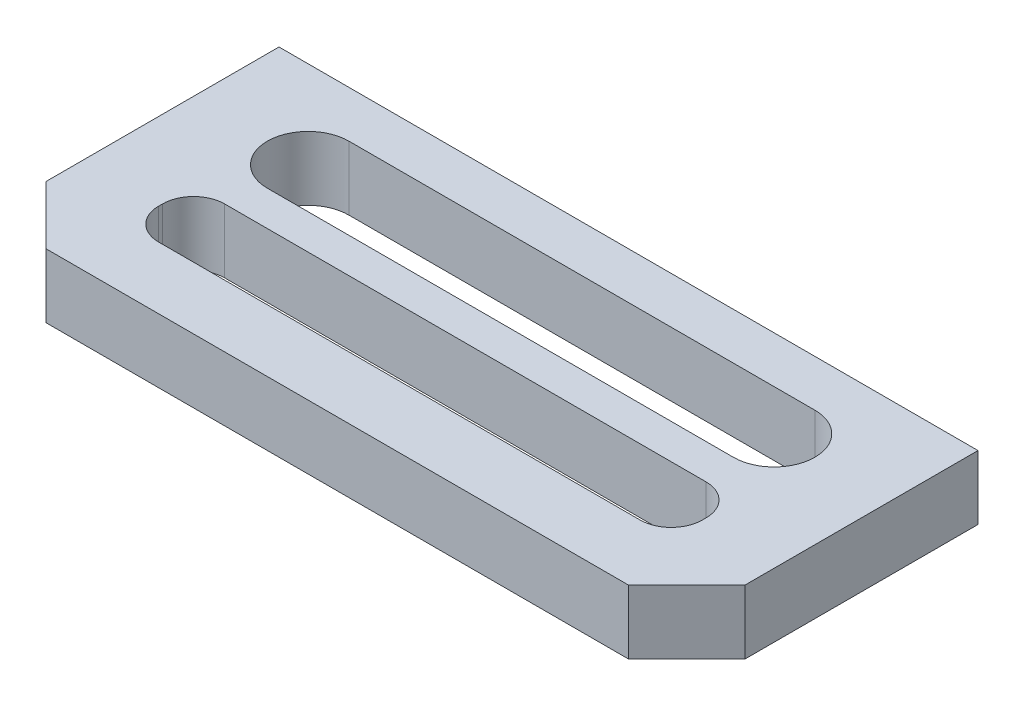
ISO-10303-21;
HEADER;
FILE_DESCRIPTION(('STEP AP214'),'2;1');
FILE_NAME('part.step','',(''),(''),'','','');
FILE_SCHEMA(('AUTOMOTIVE_DESIGN { 1 0 10303 214 1 1 1 1 }'));
ENDSEC;
DATA;
#1=APPLICATION_CONTEXT('core data for automotive mechanical design processes');
#2=APPLICATION_PROTOCOL_DEFINITION('international standard','automotive_design',2000,#1);
#3=PRODUCT_CONTEXT('',#1,'mechanical');
#4=PRODUCT('Part','Part','',(#3));
#5=PRODUCT_RELATED_PRODUCT_CATEGORY('part','',(#4));
#6=PRODUCT_DEFINITION_FORMATION('','',#4);
#7=PRODUCT_DEFINITION_CONTEXT('part definition',#1,'design');
#8=PRODUCT_DEFINITION('design','',#6,#7);
#9=PRODUCT_DEFINITION_SHAPE('','',#8);
#10=(LENGTH_UNIT() NAMED_UNIT(*) SI_UNIT(.MILLI.,.METRE.));
#11=(NAMED_UNIT(*) PLANE_ANGLE_UNIT() SI_UNIT($,.RADIAN.));
#12=(NAMED_UNIT(*) SI_UNIT($,.STERADIAN.) SOLID_ANGLE_UNIT());
#13=UNCERTAINTY_MEASURE_WITH_UNIT(LENGTH_MEASURE(1.E-05),#10,'distance_accuracy_value','');
#14=(GEOMETRIC_REPRESENTATION_CONTEXT(3) GLOBAL_UNCERTAINTY_ASSIGNED_CONTEXT((#13)) GLOBAL_UNIT_ASSIGNED_CONTEXT((#10,
#11,#12)) REPRESENTATION_CONTEXT('',''));
#15=CARTESIAN_POINT('',(0.,0.,0.));
#16=DIRECTION('',(0.,0.,1.));
#17=DIRECTION('',(1.,0.,0.));
#18=AXIS2_PLACEMENT_3D('',#15,#16,#17);
#19=CARTESIAN_POINT('',(-9.,-0.825,-3.75));
#20=DIRECTION('',(-1.,0.,0.));
#21=DIRECTION('',(0.,0.,1.));
#22=AXIS2_PLACEMENT_3D('',#19,#20,#21);
#23=PLANE('',#22);
#24=DIRECTION('',(0.,0.,1.));
#25=VECTOR('',#24,1.);
#26=CARTESIAN_POINT('',(-9.,-0.825,-3.75));
#27=LINE('',#26,#25);
#28=CARTESIAN_POINT('',(-9.,-0.825,-3.75));
#29=VERTEX_POINT('',#28);
#30=CARTESIAN_POINT('',(-9.,-0.825,2.25));
#31=VERTEX_POINT('',#30);
#32=EDGE_CURVE('E226',#29,#31,#27,.T.);
#33=ORIENTED_EDGE('',*,*,#32,.T.);
#34=DIRECTION('',(0.,1.,0.));
#35=VECTOR('',#34,1.);
#36=CARTESIAN_POINT('',(-9.,-0.825,2.25));
#37=LINE('',#36,#35);
#38=CARTESIAN_POINT('',(-9.,0.825,2.25));
#39=VERTEX_POINT('',#38);
#40=EDGE_CURVE('E287',#31,#39,#37,.T.);
#41=ORIENTED_EDGE('',*,*,#40,.T.);
#42=DIRECTION('',(0.,0.,1.));
#43=VECTOR('',#42,1.);
#44=CARTESIAN_POINT('',(-9.,0.825,-3.75));
#45=LINE('',#44,#43);
#46=CARTESIAN_POINT('',(-9.,0.825,-3.75));
#47=VERTEX_POINT('',#46);
#48=EDGE_CURVE('E215',#47,#39,#45,.T.);
#49=ORIENTED_EDGE('',*,*,#48,.F.);
#50=DIRECTION('',(0.,1.,0.));
#51=VECTOR('',#50,1.);
#52=CARTESIAN_POINT('',(-9.,-0.825,-3.75));
#53=LINE('',#52,#51);
#54=EDGE_CURVE('E247',#29,#47,#53,.T.);
#55=ORIENTED_EDGE('',*,*,#54,.F.);
#56=EDGE_LOOP('',(#33,#41,#49,#55));
#57=FACE_BOUND('',#56,.T.);
#58=ADVANCED_FACE('F33',(#57),#23,.T.);
#59=CARTESIAN_POINT('',(-9.,-0.825,-3.75));
#60=DIRECTION('',(0.,0.,-1.));
#61=DIRECTION('',(-1.,0.,0.));
#62=AXIS2_PLACEMENT_3D('',#59,#60,#61);
#63=PLANE('',#62);
#64=DIRECTION('',(-1.,0.,0.));
#65=VECTOR('',#64,1.);
#66=CARTESIAN_POINT('',(-9.,0.825,-3.75));
#67=LINE('',#66,#65);
#68=CARTESIAN_POINT('',(9.,0.825,-3.75));
#69=VERTEX_POINT('',#68);
#70=EDGE_CURVE('E230',#69,#47,#67,.T.);
#71=ORIENTED_EDGE('',*,*,#70,.F.);
#72=DIRECTION('',(0.,1.,0.));
#73=VECTOR('',#72,1.);
#74=CARTESIAN_POINT('',(9.,-0.825,-3.75));
#75=LINE('',#74,#73);
#76=CARTESIAN_POINT('',(9.,-0.825,-3.75));
#77=VERTEX_POINT('',#76);
#78=EDGE_CURVE('E237',#77,#69,#75,.T.);
#79=ORIENTED_EDGE('',*,*,#78,.F.);
#80=DIRECTION('',(-1.,0.,0.));
#81=VECTOR('',#80,1.);
#82=CARTESIAN_POINT('',(-9.,-0.825,-3.75));
#83=LINE('',#82,#81);
#84=EDGE_CURVE('E234',#77,#29,#83,.T.);
#85=ORIENTED_EDGE('',*,*,#84,.T.);
#86=ORIENTED_EDGE('',*,*,#54,.T.);
#87=EDGE_LOOP('',(#71,#79,#85,#86));
#88=FACE_BOUND('',#87,.T.);
#89=ADVANCED_FACE('F319',(#88),#63,.T.);
#90=CARTESIAN_POINT('',(9.,-0.825,-3.75));
#91=DIRECTION('',(1.,0.,0.));
#92=DIRECTION('',(0.,0.,-1.));
#93=AXIS2_PLACEMENT_3D('',#90,#91,#92);
#94=PLANE('',#93);
#95=DIRECTION('',(0.,0.,-1.));
#96=VECTOR('',#95,1.);
#97=CARTESIAN_POINT('',(9.,0.825,-3.75));
#98=LINE('',#97,#96);
#99=CARTESIAN_POINT('',(9.,0.825,2.24999999999999));
#100=VERTEX_POINT('',#99);
#101=EDGE_CURVE('E243',#100,#69,#98,.T.);
#102=ORIENTED_EDGE('',*,*,#101,.F.);
#103=DIRECTION('',(0.,-1.,0.));
#104=VECTOR('',#103,1.);
#105=CARTESIAN_POINT('',(9.,-0.825,2.25));
#106=LINE('',#105,#104);
#107=CARTESIAN_POINT('',(9.,-0.825,2.25));
#108=VERTEX_POINT('',#107);
#109=EDGE_CURVE('E11',#100,#108,#106,.T.);
#110=ORIENTED_EDGE('',*,*,#109,.T.);
#111=DIRECTION('',(0.,0.,-1.));
#112=VECTOR('',#111,1.);
#113=CARTESIAN_POINT('',(9.,-0.825,-3.75));
#114=LINE('',#113,#112);
#115=EDGE_CURVE('E232',#108,#77,#114,.T.);
#116=ORIENTED_EDGE('',*,*,#115,.T.);
#117=ORIENTED_EDGE('',*,*,#78,.T.);
#118=EDGE_LOOP('',(#102,#110,#116,#117));
#119=FACE_BOUND('',#118,.T.);
#120=ADVANCED_FACE('F315',(#119),#94,.T.);
#121=CARTESIAN_POINT('',(-9.,-0.825,3.75));
#122=DIRECTION('',(0.,0.,1.));
#123=DIRECTION('',(1.,0.,0.));
#124=AXIS2_PLACEMENT_3D('',#121,#122,#123);
#125=PLANE('',#124);
#126=DIRECTION('',(1.,0.,0.));
#127=VECTOR('',#126,1.);
#128=CARTESIAN_POINT('',(-9.,0.825,3.75));
#129=LINE('',#128,#127);
#130=CARTESIAN_POINT('',(-7.49999999999999,0.825,3.75));
#131=VERTEX_POINT('',#130);
#132=CARTESIAN_POINT('',(7.5,0.825,3.75));
#133=VERTEX_POINT('',#132);
#134=EDGE_CURVE('E240',#131,#133,#129,.T.);
#135=ORIENTED_EDGE('',*,*,#134,.F.);
#136=DIRECTION('',(0.,-1.,0.));
#137=VECTOR('',#136,1.);
#138=CARTESIAN_POINT('',(-7.49999999999999,-0.825,3.75));
#139=LINE('',#138,#137);
#140=CARTESIAN_POINT('',(-7.49999999999999,-0.825,3.75));
#141=VERTEX_POINT('',#140);
#142=EDGE_CURVE('E297',#131,#141,#139,.T.);
#143=ORIENTED_EDGE('',*,*,#142,.T.);
#144=DIRECTION('',(1.,0.,0.));
#145=VECTOR('',#144,1.);
#146=CARTESIAN_POINT('',(-9.,-0.825,3.75));
#147=LINE('',#146,#145);
#148=CARTESIAN_POINT('',(7.5,-0.825,3.75));
#149=VERTEX_POINT('',#148);
#150=EDGE_CURVE('E229',#141,#149,#147,.T.);
#151=ORIENTED_EDGE('',*,*,#150,.T.);
#152=DIRECTION('',(0.,1.,0.));
#153=VECTOR('',#152,1.);
#154=CARTESIAN_POINT('',(7.5,-0.825,3.75));
#155=LINE('',#154,#153);
#156=EDGE_CURVE('E294',#149,#133,#155,.T.);
#157=ORIENTED_EDGE('',*,*,#156,.T.);
#158=EDGE_LOOP('',(#135,#143,#151,#157));
#159=FACE_BOUND('',#158,.T.);
#160=ADVANCED_FACE('F312',(#159),#125,.T.);
#161=CARTESIAN_POINT('',(0.,-0.825,0.));
#162=DIRECTION('',(0.,1.,0.));
#163=DIRECTION('',(0.,0.,1.));
#164=AXIS2_PLACEMENT_3D('',#161,#162,#163);
#165=PLANE('',#164);
#166=DIRECTION('',(-1.,0.,0.));
#167=VECTOR('',#166,1.);
#168=CARTESIAN_POINT('',(-6.,-0.825,-2.55));
#169=LINE('',#168,#167);
#170=CARTESIAN_POINT('',(6.,-0.825,-2.55));
#171=VERTEX_POINT('',#170);
#172=CARTESIAN_POINT('',(-6.,-0.825,-2.55));
#173=VERTEX_POINT('',#172);
#174=EDGE_CURVE('E170',#171,#173,#169,.T.);
#175=ORIENTED_EDGE('',*,*,#174,.T.);
#176=CARTESIAN_POINT('',(-6.,-0.825,-1.5));
#177=DIRECTION('',(0.,1.,0.));
#178=DIRECTION('',(0.,0.,1.));
#179=AXIS2_PLACEMENT_3D('',#176,#177,#178);
#180=CIRCLE('',#179,1.05);
#181=CARTESIAN_POINT('',(-6.,-0.825,-0.449999999999999));
#182=VERTEX_POINT('',#181);
#183=EDGE_CURVE('E162',#173,#182,#180,.T.);
#184=ORIENTED_EDGE('',*,*,#183,.T.);
#185=DIRECTION('',(1.,0.,0.));
#186=VECTOR('',#185,1.);
#187=CARTESIAN_POINT('',(-6.,-0.825,-0.449999999999999));
#188=LINE('',#187,#186);
#189=CARTESIAN_POINT('',(6.,-0.825,-0.450000000000001));
#190=VERTEX_POINT('',#189);
#191=EDGE_CURVE('E174',#182,#190,#188,.T.);
#192=ORIENTED_EDGE('',*,*,#191,.T.);
#193=CARTESIAN_POINT('',(6.,-0.825,-1.5));
#194=DIRECTION('',(0.,1.,0.));
#195=DIRECTION('',(0.,0.,1.));
#196=AXIS2_PLACEMENT_3D('',#193,#194,#195);
#197=CIRCLE('',#196,1.05);
#198=EDGE_CURVE('E178',#190,#171,#197,.T.);
#199=ORIENTED_EDGE('',*,*,#198,.T.);
#200=EDGE_LOOP('',(#175,#184,#192,#199));
#201=FACE_BOUND('',#200,.T.);
#202=DIRECTION('',(0.,0.,-1.));
#203=VECTOR('',#202,1.);
#204=CARTESIAN_POINT('',(7.,-0.825,0.45));
#205=LINE('',#204,#203);
#206=CARTESIAN_POINT('',(7.,-0.825,1.35));
#207=VERTEX_POINT('',#206);
#208=CARTESIAN_POINT('',(7.,-0.825,1.25));
#209=VERTEX_POINT('',#208);
#210=EDGE_CURVE('E209',#207,#209,#205,.T.);
#211=ORIENTED_EDGE('',*,*,#210,.T.);
#212=CARTESIAN_POINT('',(6.2,-0.825,1.25));
#213=DIRECTION('',(0.,1.,0.));
#214=DIRECTION('',(0.,0.,1.));
#215=AXIS2_PLACEMENT_3D('',#212,#213,#214);
#216=CIRCLE('',#215,0.8);
#217=CARTESIAN_POINT('',(6.2,-0.825,0.45));
#218=VERTEX_POINT('',#217);
#219=EDGE_CURVE('E273',#209,#218,#216,.T.);
#220=ORIENTED_EDGE('',*,*,#219,.T.);
#221=DIRECTION('',(-1.,0.,0.));
#222=VECTOR('',#221,1.);
#223=CARTESIAN_POINT('',(-7.,-0.825,0.45));
#224=LINE('',#223,#222);
#225=CARTESIAN_POINT('',(-6.2,-0.825,0.45));
#226=VERTEX_POINT('',#225);
#227=EDGE_CURVE('E212',#218,#226,#224,.T.);
#228=ORIENTED_EDGE('',*,*,#227,.T.);
#229=CARTESIAN_POINT('',(-6.2,-0.825,1.25));
#230=DIRECTION('',(0.,1.,0.));
#231=DIRECTION('',(0.,0.,1.));
#232=AXIS2_PLACEMENT_3D('',#229,#230,#231);
#233=CIRCLE('',#232,0.8);
#234=CARTESIAN_POINT('',(-7.,-0.825,1.25));
#235=VERTEX_POINT('',#234);
#236=EDGE_CURVE('E285',#226,#235,#233,.T.);
#237=ORIENTED_EDGE('',*,*,#236,.T.);
#238=DIRECTION('',(0.,0.,1.));
#239=VECTOR('',#238,1.);
#240=CARTESIAN_POINT('',(-7.,-0.825,0.45));
#241=LINE('',#240,#239);
#242=CARTESIAN_POINT('',(-7.,-0.825,1.35));
#243=VERTEX_POINT('',#242);
#244=EDGE_CURVE('E202',#235,#243,#241,.T.);
#245=ORIENTED_EDGE('',*,*,#244,.T.);
#246=CARTESIAN_POINT('',(-6.2,-0.825,1.35));
#247=DIRECTION('',(0.,1.,0.));
#248=DIRECTION('',(0.,0.,1.));
#249=AXIS2_PLACEMENT_3D('',#246,#247,#248);
#250=CIRCLE('',#249,0.8);
#251=CARTESIAN_POINT('',(-6.2,-0.825,2.15));
#252=VERTEX_POINT('',#251);
#253=EDGE_CURVE('E281',#243,#252,#250,.T.);
#254=ORIENTED_EDGE('',*,*,#253,.T.);
#255=DIRECTION('',(1.,0.,0.));
#256=VECTOR('',#255,1.);
#257=CARTESIAN_POINT('',(-7.,-0.825,2.15));
#258=LINE('',#257,#256);
#259=CARTESIAN_POINT('',(6.2,-0.825,2.15));
#260=VERTEX_POINT('',#259);
#261=EDGE_CURVE('E205',#252,#260,#258,.T.);
#262=ORIENTED_EDGE('',*,*,#261,.T.);
#263=CARTESIAN_POINT('',(6.2,-0.825,1.35));
#264=DIRECTION('',(0.,1.,0.));
#265=DIRECTION('',(0.,0.,1.));
#266=AXIS2_PLACEMENT_3D('',#263,#264,#265);
#267=CIRCLE('',#266,0.8);
#268=EDGE_CURVE('E277',#260,#207,#267,.T.);
#269=ORIENTED_EDGE('',*,*,#268,.T.);
#270=EDGE_LOOP('',(#211,#220,#228,#237,#245,#254,#262,#269));
#271=FACE_BOUND('',#270,.T.);
#272=ORIENTED_EDGE('',*,*,#150,.F.);
#273=DIRECTION('',(0.707106781186549,0.,0.707106781186546));
#274=VECTOR('',#273,1.);
#275=CARTESIAN_POINT('',(-9.,-0.825,2.25));
#276=LINE('',#275,#274);
#277=EDGE_CURVE('E41',#141,#31,#276,.F.);
#278=ORIENTED_EDGE('',*,*,#277,.T.);
#279=ORIENTED_EDGE('',*,*,#32,.F.);
#280=ORIENTED_EDGE('',*,*,#84,.F.);
#281=ORIENTED_EDGE('',*,*,#115,.F.);
#282=DIRECTION('',(0.707106781186546,0.,-0.707106781186549));
#283=VECTOR('',#282,1.);
#284=CARTESIAN_POINT('',(7.5,-0.825,3.75));
#285=LINE('',#284,#283);
#286=EDGE_CURVE('E53',#108,#149,#285,.F.);
#287=ORIENTED_EDGE('',*,*,#286,.T.);
#288=EDGE_LOOP('',(#272,#278,#279,#280,#281,#287));
#289=FACE_BOUND('',#288,.T.);
#290=ADVANCED_FACE('F180',(#201,#271,#289),#165,.F.);
#291=CARTESIAN_POINT('',(0.,0.825,0.));
#292=DIRECTION('',(0.,1.,0.));
#293=DIRECTION('',(0.,0.,1.));
#294=AXIS2_PLACEMENT_3D('',#291,#292,#293);
#295=PLANE('',#294);
#296=CARTESIAN_POINT('',(-6.,0.825,-1.5));
#297=DIRECTION('',(0.,1.,0.));
#298=DIRECTION('',(0.,0.,1.));
#299=AXIS2_PLACEMENT_3D('',#296,#297,#298);
#300=CIRCLE('',#299,1.05);
#301=CARTESIAN_POINT('',(-6.,0.825,-2.55));
#302=VERTEX_POINT('',#301);
#303=CARTESIAN_POINT('',(-6.,0.825,-0.449999999999999));
#304=VERTEX_POINT('',#303);
#305=EDGE_CURVE('E165',#302,#304,#300,.T.);
#306=ORIENTED_EDGE('',*,*,#305,.F.);
#307=DIRECTION('',(-1.,0.,0.));
#308=VECTOR('',#307,1.);
#309=CARTESIAN_POINT('',(-6.,0.825,-2.55));
#310=LINE('',#309,#308);
#311=CARTESIAN_POINT('',(6.,0.825,-2.55));
#312=VERTEX_POINT('',#311);
#313=EDGE_CURVE('E183',#312,#302,#310,.T.);
#314=ORIENTED_EDGE('',*,*,#313,.F.);
#315=CARTESIAN_POINT('',(6.,0.825,-1.5));
#316=DIRECTION('',(0.,1.,0.));
#317=DIRECTION('',(0.,0.,1.));
#318=AXIS2_PLACEMENT_3D('',#315,#316,#317);
#319=CIRCLE('',#318,1.05);
#320=CARTESIAN_POINT('',(6.,0.825,-0.450000000000001));
#321=VERTEX_POINT('',#320);
#322=EDGE_CURVE('E186',#321,#312,#319,.T.);
#323=ORIENTED_EDGE('',*,*,#322,.F.);
#324=DIRECTION('',(1.,0.,0.));
#325=VECTOR('',#324,1.);
#326=CARTESIAN_POINT('',(-6.,0.825,-0.449999999999999));
#327=LINE('',#326,#325);
#328=EDGE_CURVE('E192',#304,#321,#327,.T.);
#329=ORIENTED_EDGE('',*,*,#328,.F.);
#330=EDGE_LOOP('',(#306,#314,#323,#329));
#331=FACE_BOUND('',#330,.T.);
#332=DIRECTION('',(0.,0.,1.));
#333=VECTOR('',#332,1.);
#334=CARTESIAN_POINT('',(-7.,0.825,0.45));
#335=LINE('',#334,#333);
#336=CARTESIAN_POINT('',(-7.,0.825,1.25));
#337=VERTEX_POINT('',#336);
#338=CARTESIAN_POINT('',(-7.,0.825,1.35));
#339=VERTEX_POINT('',#338);
#340=EDGE_CURVE('E198',#337,#339,#335,.T.);
#341=ORIENTED_EDGE('',*,*,#340,.F.);
#342=CARTESIAN_POINT('',(-6.2,0.825,1.25));
#343=DIRECTION('',(0.,1.,0.));
#344=DIRECTION('',(0.,0.,1.));
#345=AXIS2_PLACEMENT_3D('',#342,#343,#344);
#346=CIRCLE('',#345,0.8);
#347=CARTESIAN_POINT('',(-6.2,0.825,0.45));
#348=VERTEX_POINT('',#347);
#349=EDGE_CURVE('E283',#337,#348,#346,.F.);
#350=ORIENTED_EDGE('',*,*,#349,.T.);
#351=DIRECTION('',(-1.,0.,0.));
#352=VECTOR('',#351,1.);
#353=CARTESIAN_POINT('',(-7.,0.825,0.45));
#354=LINE('',#353,#352);
#355=CARTESIAN_POINT('',(6.2,0.825,0.45));
#356=VERTEX_POINT('',#355);
#357=EDGE_CURVE('E206',#356,#348,#354,.T.);
#358=ORIENTED_EDGE('',*,*,#357,.F.);
#359=CARTESIAN_POINT('',(6.2,0.825,1.25));
#360=DIRECTION('',(0.,1.,0.));
#361=DIRECTION('',(0.,0.,1.));
#362=AXIS2_PLACEMENT_3D('',#359,#360,#361);
#363=CIRCLE('',#362,0.8);
#364=CARTESIAN_POINT('',(7.,0.825,1.25));
#365=VERTEX_POINT('',#364);
#366=EDGE_CURVE('E271',#356,#365,#363,.F.);
#367=ORIENTED_EDGE('',*,*,#366,.T.);
#368=DIRECTION('',(0.,0.,-1.));
#369=VECTOR('',#368,1.);
#370=CARTESIAN_POINT('',(7.,0.825,0.45));
#371=LINE('',#370,#369);
#372=CARTESIAN_POINT('',(7.,0.825,1.35));
#373=VERTEX_POINT('',#372);
#374=EDGE_CURVE('E221',#373,#365,#371,.T.);
#375=ORIENTED_EDGE('',*,*,#374,.F.);
#376=CARTESIAN_POINT('',(6.2,0.825,1.35));
#377=DIRECTION('',(0.,1.,0.));
#378=DIRECTION('',(0.,0.,1.));
#379=AXIS2_PLACEMENT_3D('',#376,#377,#378);
#380=CIRCLE('',#379,0.8);
#381=CARTESIAN_POINT('',(6.2,0.825,2.15));
#382=VERTEX_POINT('',#381);
#383=EDGE_CURVE('E275',#373,#382,#380,.F.);
#384=ORIENTED_EDGE('',*,*,#383,.T.);
#385=DIRECTION('',(1.,0.,0.));
#386=VECTOR('',#385,1.);
#387=CARTESIAN_POINT('',(-7.,0.825,2.15));
#388=LINE('',#387,#386);
#389=CARTESIAN_POINT('',(-6.2,0.825,2.15));
#390=VERTEX_POINT('',#389);
#391=EDGE_CURVE('E218',#390,#382,#388,.T.);
#392=ORIENTED_EDGE('',*,*,#391,.F.);
#393=CARTESIAN_POINT('',(-6.2,0.825,1.35));
#394=DIRECTION('',(0.,1.,0.));
#395=DIRECTION('',(0.,0.,1.));
#396=AXIS2_PLACEMENT_3D('',#393,#394,#395);
#397=CIRCLE('',#396,0.8);
#398=EDGE_CURVE('E279',#390,#339,#397,.F.);
#399=ORIENTED_EDGE('',*,*,#398,.T.);
#400=EDGE_LOOP('',(#341,#350,#358,#367,#375,#384,#392,#399));
#401=FACE_BOUND('',#400,.T.);
#402=ORIENTED_EDGE('',*,*,#48,.T.);
#403=DIRECTION('',(-0.707106781186549,0.,-0.707106781186546));
#404=VECTOR('',#403,1.);
#405=CARTESIAN_POINT('',(-5.62499999999998,0.825,5.62500000000001));
#406=LINE('',#405,#404);
#407=EDGE_CURVE('E292',#39,#131,#406,.F.);
#408=ORIENTED_EDGE('',*,*,#407,.T.);
#409=ORIENTED_EDGE('',*,*,#134,.T.);
#410=DIRECTION('',(-0.707106781186546,0.,0.707106781186549));
#411=VECTOR('',#410,1.);
#412=CARTESIAN_POINT('',(5.62500000000002,0.825,5.62499999999999));
#413=LINE('',#412,#411);
#414=EDGE_CURVE('E290',#133,#100,#413,.F.);
#415=ORIENTED_EDGE('',*,*,#414,.T.);
#416=ORIENTED_EDGE('',*,*,#101,.T.);
#417=ORIENTED_EDGE('',*,*,#70,.T.);
#418=EDGE_LOOP('',(#402,#408,#409,#415,#416,#417));
#419=FACE_BOUND('',#418,.T.);
#420=ADVANCED_FACE('F310',(#331,#401,#419),#295,.T.);
#421=CARTESIAN_POINT('',(-7.,-0.825,0.45));
#422=DIRECTION('',(-1.,0.,0.));
#423=DIRECTION('',(0.,0.,1.));
#424=AXIS2_PLACEMENT_3D('',#421,#422,#423);
#425=PLANE('',#424);
#426=ORIENTED_EDGE('',*,*,#340,.T.);
#427=DIRECTION('',(0.,1.,0.));
#428=VECTOR('',#427,1.);
#429=CARTESIAN_POINT('',(-7.,-0.825,1.35));
#430=LINE('',#429,#428);
#431=EDGE_CURVE('E269',#339,#243,#430,.F.);
#432=ORIENTED_EDGE('',*,*,#431,.T.);
#433=ORIENTED_EDGE('',*,*,#244,.F.);
#434=DIRECTION('',(0.,1.,0.));
#435=VECTOR('',#434,1.);
#436=CARTESIAN_POINT('',(-7.,0.825,1.25));
#437=LINE('',#436,#435);
#438=EDGE_CURVE('E266',#235,#337,#437,.T.);
#439=ORIENTED_EDGE('',*,*,#438,.T.);
#440=EDGE_LOOP('',(#426,#432,#433,#439));
#441=FACE_BOUND('',#440,.T.);
#442=ADVANCED_FACE('F368',(#441),#425,.F.);
#443=CARTESIAN_POINT('',(-7.,-0.825,0.45));
#444=DIRECTION('',(0.,0.,-1.));
#445=DIRECTION('',(-1.,0.,0.));
#446=AXIS2_PLACEMENT_3D('',#443,#444,#445);
#447=PLANE('',#446);
#448=ORIENTED_EDGE('',*,*,#227,.F.);
#449=DIRECTION('',(0.,1.,0.));
#450=VECTOR('',#449,1.);
#451=CARTESIAN_POINT('',(6.2,0.825,0.45));
#452=LINE('',#451,#450);
#453=EDGE_CURVE('E253',#218,#356,#452,.T.);
#454=ORIENTED_EDGE('',*,*,#453,.T.);
#455=ORIENTED_EDGE('',*,*,#357,.T.);
#456=DIRECTION('',(0.,1.,0.));
#457=VECTOR('',#456,1.);
#458=CARTESIAN_POINT('',(-6.2,-0.825,0.45));
#459=LINE('',#458,#457);
#460=EDGE_CURVE('E249',#348,#226,#459,.F.);
#461=ORIENTED_EDGE('',*,*,#460,.T.);
#462=EDGE_LOOP('',(#448,#454,#455,#461));
#463=FACE_BOUND('',#462,.T.);
#464=ADVANCED_FACE('F443',(#463),#447,.F.);
#465=CARTESIAN_POINT('',(7.,-0.825,0.45));
#466=DIRECTION('',(1.,0.,0.));
#467=DIRECTION('',(0.,0.,-1.));
#468=AXIS2_PLACEMENT_3D('',#465,#466,#467);
#469=PLANE('',#468);
#470=ORIENTED_EDGE('',*,*,#374,.T.);
#471=DIRECTION('',(0.,1.,0.));
#472=VECTOR('',#471,1.);
#473=CARTESIAN_POINT('',(7.,-0.825,1.25));
#474=LINE('',#473,#472);
#475=EDGE_CURVE('E259',#365,#209,#474,.F.);
#476=ORIENTED_EDGE('',*,*,#475,.T.);
#477=ORIENTED_EDGE('',*,*,#210,.F.);
#478=DIRECTION('',(0.,1.,0.));
#479=VECTOR('',#478,1.);
#480=CARTESIAN_POINT('',(7.,0.825,1.35));
#481=LINE('',#480,#479);
#482=EDGE_CURVE('E256',#207,#373,#481,.T.);
#483=ORIENTED_EDGE('',*,*,#482,.T.);
#484=EDGE_LOOP('',(#470,#476,#477,#483));
#485=FACE_BOUND('',#484,.T.);
#486=ADVANCED_FACE('F431',(#485),#469,.F.);
#487=CARTESIAN_POINT('',(-7.,-0.825,2.15));
#488=DIRECTION('',(0.,0.,1.));
#489=DIRECTION('',(1.,0.,0.));
#490=AXIS2_PLACEMENT_3D('',#487,#488,#489);
#491=PLANE('',#490);
#492=ORIENTED_EDGE('',*,*,#391,.T.);
#493=DIRECTION('',(0.,1.,0.));
#494=VECTOR('',#493,1.);
#495=CARTESIAN_POINT('',(6.2,-0.825,2.15));
#496=LINE('',#495,#494);
#497=EDGE_CURVE('E264',#382,#260,#496,.F.);
#498=ORIENTED_EDGE('',*,*,#497,.T.);
#499=ORIENTED_EDGE('',*,*,#261,.F.);
#500=DIRECTION('',(0.,1.,0.));
#501=VECTOR('',#500,1.);
#502=CARTESIAN_POINT('',(-6.2,0.825,2.15));
#503=LINE('',#502,#501);
#504=EDGE_CURVE('E261',#252,#390,#503,.T.);
#505=ORIENTED_EDGE('',*,*,#504,.T.);
#506=EDGE_LOOP('',(#492,#498,#499,#505));
#507=FACE_BOUND('',#506,.T.);
#508=ADVANCED_FACE('F426',(#507),#491,.F.);
#509=CARTESIAN_POINT('',(-6.,-0.825,-1.5));
#510=DIRECTION('',(0.,1.,0.));
#511=DIRECTION('',(0.,0.,1.));
#512=AXIS2_PLACEMENT_3D('',#509,#510,#511);
#513=CYLINDRICAL_SURFACE('',#512,1.05);
#514=ORIENTED_EDGE('',*,*,#305,.T.);
#515=DIRECTION('',(0.,1.,0.));
#516=VECTOR('',#515,1.);
#517=CARTESIAN_POINT('',(-6.,-0.825,-0.449999999999999));
#518=LINE('',#517,#516);
#519=EDGE_CURVE('E158',#182,#304,#518,.T.);
#520=ORIENTED_EDGE('',*,*,#519,.F.);
#521=ORIENTED_EDGE('',*,*,#183,.F.);
#522=DIRECTION('',(0.,1.,0.));
#523=VECTOR('',#522,1.);
#524=CARTESIAN_POINT('',(-6.,-0.825,-2.55));
#525=LINE('',#524,#523);
#526=EDGE_CURVE('E196',#173,#302,#525,.T.);
#527=ORIENTED_EDGE('',*,*,#526,.T.);
#528=EDGE_LOOP('',(#514,#520,#521,#527));
#529=FACE_BOUND('',#528,.T.);
#530=ADVANCED_FACE('F160',(#529),#513,.F.);
#531=CARTESIAN_POINT('',(-6.,-0.825,-2.55));
#532=DIRECTION('',(0.,0.,-1.));
#533=DIRECTION('',(-1.,0.,0.));
#534=AXIS2_PLACEMENT_3D('',#531,#532,#533);
#535=PLANE('',#534);
#536=ORIENTED_EDGE('',*,*,#313,.T.);
#537=ORIENTED_EDGE('',*,*,#526,.F.);
#538=ORIENTED_EDGE('',*,*,#174,.F.);
#539=DIRECTION('',(0.,1.,0.));
#540=VECTOR('',#539,1.);
#541=CARTESIAN_POINT('',(6.,-0.825,-2.55));
#542=LINE('',#541,#540);
#543=EDGE_CURVE('E199',#171,#312,#542,.T.);
#544=ORIENTED_EDGE('',*,*,#543,.T.);
#545=EDGE_LOOP('',(#536,#537,#538,#544));
#546=FACE_BOUND('',#545,.T.);
#547=ADVANCED_FACE('F476',(#546),#535,.F.);
#548=CARTESIAN_POINT('',(6.,-0.825,-1.5));
#549=DIRECTION('',(0.,1.,0.));
#550=DIRECTION('',(0.,0.,1.));
#551=AXIS2_PLACEMENT_3D('',#548,#549,#550);
#552=CYLINDRICAL_SURFACE('',#551,1.05);
#553=ORIENTED_EDGE('',*,*,#322,.T.);
#554=ORIENTED_EDGE('',*,*,#543,.F.);
#555=ORIENTED_EDGE('',*,*,#198,.F.);
#556=DIRECTION('',(0.,1.,0.));
#557=VECTOR('',#556,1.);
#558=CARTESIAN_POINT('',(6.,-0.825,-0.450000000000001));
#559=LINE('',#558,#557);
#560=EDGE_CURVE('E169',#190,#321,#559,.T.);
#561=ORIENTED_EDGE('',*,*,#560,.T.);
#562=EDGE_LOOP('',(#553,#554,#555,#561));
#563=FACE_BOUND('',#562,.T.);
#564=ADVANCED_FACE('F467',(#563),#552,.F.);
#565=CARTESIAN_POINT('',(-6.,-0.825,-0.449999999999999));
#566=DIRECTION('',(0.,0.,1.));
#567=DIRECTION('',(1.,0.,0.));
#568=AXIS2_PLACEMENT_3D('',#565,#566,#567);
#569=PLANE('',#568);
#570=ORIENTED_EDGE('',*,*,#328,.T.);
#571=ORIENTED_EDGE('',*,*,#560,.F.);
#572=ORIENTED_EDGE('',*,*,#191,.F.);
#573=ORIENTED_EDGE('',*,*,#519,.T.);
#574=EDGE_LOOP('',(#570,#571,#572,#573));
#575=FACE_BOUND('',#574,.T.);
#576=ADVANCED_FACE('F175',(#575),#569,.F.);
#577=CARTESIAN_POINT('',(6.2,-0.825,1.25));
#578=DIRECTION('',(0.,-1.,0.));
#579=DIRECTION('',(0.,0.,-1.));
#580=AXIS2_PLACEMENT_3D('',#577,#578,#579);
#581=CYLINDRICAL_SURFACE('',#580,0.8);
#582=ORIENTED_EDGE('',*,*,#219,.F.);
#583=ORIENTED_EDGE('',*,*,#475,.F.);
#584=ORIENTED_EDGE('',*,*,#366,.F.);
#585=ORIENTED_EDGE('',*,*,#453,.F.);
#586=EDGE_LOOP('',(#582,#583,#584,#585));
#587=FACE_BOUND('',#586,.T.);
#588=ADVANCED_FACE('F333',(#587),#581,.F.);
#589=CARTESIAN_POINT('',(6.2,-0.825,1.35));
#590=DIRECTION('',(0.,-1.,0.));
#591=DIRECTION('',(0.,0.,-1.));
#592=AXIS2_PLACEMENT_3D('',#589,#590,#591);
#593=CYLINDRICAL_SURFACE('',#592,0.8);
#594=ORIENTED_EDGE('',*,*,#268,.F.);
#595=ORIENTED_EDGE('',*,*,#497,.F.);
#596=ORIENTED_EDGE('',*,*,#383,.F.);
#597=ORIENTED_EDGE('',*,*,#482,.F.);
#598=EDGE_LOOP('',(#594,#595,#596,#597));
#599=FACE_BOUND('',#598,.T.);
#600=ADVANCED_FACE('F336',(#599),#593,.F.);
#601=CARTESIAN_POINT('',(-6.2,-0.825,1.35));
#602=DIRECTION('',(0.,-1.,0.));
#603=DIRECTION('',(0.,0.,-1.));
#604=AXIS2_PLACEMENT_3D('',#601,#602,#603);
#605=CYLINDRICAL_SURFACE('',#604,0.8);
#606=ORIENTED_EDGE('',*,*,#253,.F.);
#607=ORIENTED_EDGE('',*,*,#431,.F.);
#608=ORIENTED_EDGE('',*,*,#398,.F.);
#609=ORIENTED_EDGE('',*,*,#504,.F.);
#610=EDGE_LOOP('',(#606,#607,#608,#609));
#611=FACE_BOUND('',#610,.T.);
#612=ADVANCED_FACE('F340',(#611),#605,.F.);
#613=CARTESIAN_POINT('',(-6.2,-0.825,1.25));
#614=DIRECTION('',(0.,-1.,0.));
#615=DIRECTION('',(0.,0.,-1.));
#616=AXIS2_PLACEMENT_3D('',#613,#614,#615);
#617=CYLINDRICAL_SURFACE('',#616,0.8);
#618=ORIENTED_EDGE('',*,*,#236,.F.);
#619=ORIENTED_EDGE('',*,*,#460,.F.);
#620=ORIENTED_EDGE('',*,*,#349,.F.);
#621=ORIENTED_EDGE('',*,*,#438,.F.);
#622=EDGE_LOOP('',(#618,#619,#620,#621));
#623=FACE_BOUND('',#622,.T.);
#624=ADVANCED_FACE('F344',(#623),#617,.F.);
#625=CARTESIAN_POINT('',(-9.,-0.825,2.25));
#626=DIRECTION('',(0.707106781186546,0.,-0.707106781186549));
#627=DIRECTION('',(0.,1.,0.));
#628=AXIS2_PLACEMENT_3D('',#625,#626,#627);
#629=PLANE('',#628);
#630=ORIENTED_EDGE('',*,*,#277,.F.);
#631=ORIENTED_EDGE('',*,*,#142,.F.);
#632=ORIENTED_EDGE('',*,*,#407,.F.);
#633=ORIENTED_EDGE('',*,*,#40,.F.);
#634=EDGE_LOOP('',(#630,#631,#632,#633));
#635=FACE_BOUND('',#634,.T.);
#636=ADVANCED_FACE('F307',(#635),#629,.F.);
#637=CARTESIAN_POINT('',(7.5,-0.825,3.75));
#638=DIRECTION('',(-0.707106781186549,0.,-0.707106781186546));
#639=DIRECTION('',(0.,1.,0.));
#640=AXIS2_PLACEMENT_3D('',#637,#638,#639);
#641=PLANE('',#640);
#642=ORIENTED_EDGE('',*,*,#286,.F.);
#643=ORIENTED_EDGE('',*,*,#109,.F.);
#644=ORIENTED_EDGE('',*,*,#414,.F.);
#645=ORIENTED_EDGE('',*,*,#156,.F.);
#646=EDGE_LOOP('',(#642,#643,#644,#645));
#647=FACE_BOUND('',#646,.T.);
#648=ADVANCED_FACE('F35',(#647),#641,.F.);
#649=CLOSED_SHELL('',(#58,#89,#120,#160,#290,#420,#442,#464,#486,#508,#530,#547,#564,#576,#588,
#600,#612,#624,#636,#648));
#650=MANIFOLD_SOLID_BREP('B2',#649);
#651=ADVANCED_BREP_SHAPE_REPRESENTATION('',(#18,#650),#14);
#652=SHAPE_DEFINITION_REPRESENTATION(#9,#651);
ENDSEC;
END-ISO-10303-21;
